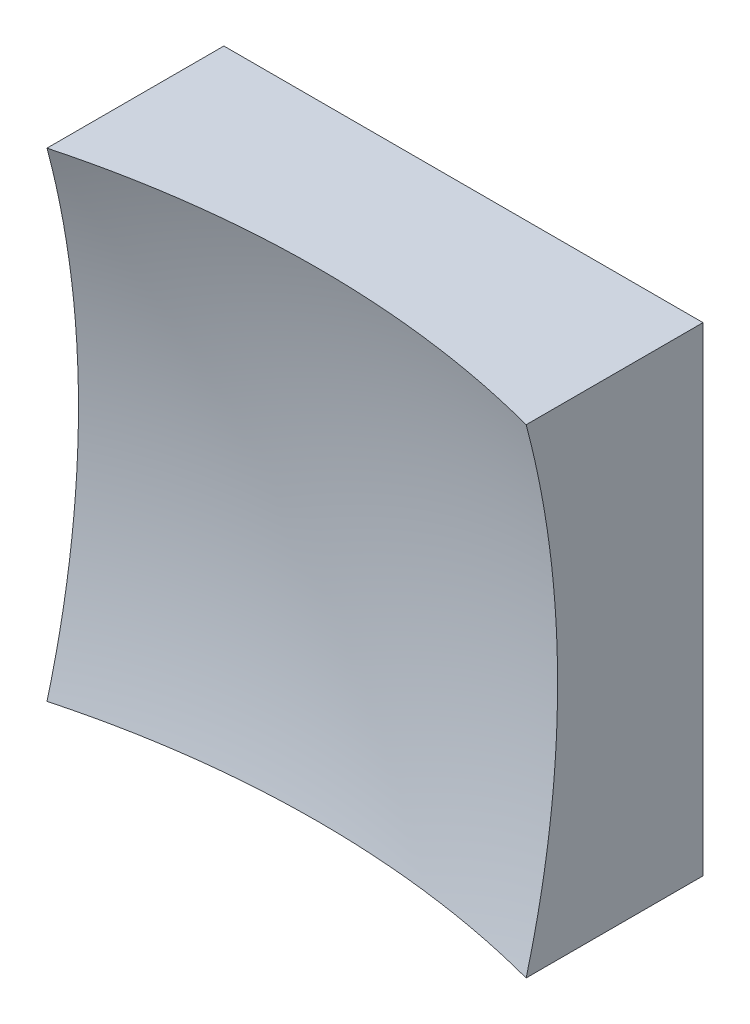
ISO-10303-21;
HEADER;
FILE_DESCRIPTION(('STEP AP214'),'2;1');
FILE_NAME('part.step','',(''),(''),'','','');
FILE_SCHEMA(('AUTOMOTIVE_DESIGN { 1 0 10303 214 1 1 1 1 }'));
ENDSEC;
DATA;
#1=APPLICATION_CONTEXT('core data for automotive mechanical design processes');
#2=APPLICATION_PROTOCOL_DEFINITION('international standard','automotive_design',2000,#1);
#3=PRODUCT_CONTEXT('',#1,'mechanical');
#4=PRODUCT('Part','Part','',(#3));
#5=PRODUCT_RELATED_PRODUCT_CATEGORY('part','',(#4));
#6=PRODUCT_DEFINITION_FORMATION('','',#4);
#7=PRODUCT_DEFINITION_CONTEXT('part definition',#1,'design');
#8=PRODUCT_DEFINITION('design','',#6,#7);
#9=PRODUCT_DEFINITION_SHAPE('','',#8);
#10=(LENGTH_UNIT() NAMED_UNIT(*) SI_UNIT(.MILLI.,.METRE.));
#11=(NAMED_UNIT(*) PLANE_ANGLE_UNIT() SI_UNIT($,.RADIAN.));
#12=(NAMED_UNIT(*) SI_UNIT($,.STERADIAN.) SOLID_ANGLE_UNIT());
#13=UNCERTAINTY_MEASURE_WITH_UNIT(LENGTH_MEASURE(1.E-05),#10,'distance_accuracy_value','');
#14=(GEOMETRIC_REPRESENTATION_CONTEXT(3) GLOBAL_UNCERTAINTY_ASSIGNED_CONTEXT((#13)) GLOBAL_UNIT_ASSIGNED_CONTEXT((#10,
#11,#12)) REPRESENTATION_CONTEXT('',''));
#15=CARTESIAN_POINT('',(0.,0.,0.));
#16=DIRECTION('',(0.,0.,1.));
#17=DIRECTION('',(1.,0.,0.));
#18=AXIS2_PLACEMENT_3D('',#15,#16,#17);
#19=CARTESIAN_POINT('',(-12.5,12.5,20.));
#20=DIRECTION('',(0.,1.,0.));
#21=DIRECTION('',(0.,0.,1.));
#22=AXIS2_PLACEMENT_3D('',#19,#20,#21);
#23=PLANE('',#22);
#24=CARTESIAN_POINT('',(0.,12.5,56.));
#25=DIRECTION('',(0.,1.,0.));
#26=DIRECTION('',(0.,0.,1.));
#27=AXIS2_PLACEMENT_3D('',#24,#25,#26);
#28=CIRCLE('',#27,48.4122918275927);
#29=CARTESIAN_POINT('',(12.5,12.5,9.22928266532573));
#30=VERTEX_POINT('',#29);
#31=CARTESIAN_POINT('',(-12.5,12.5,9.22928266532573));
#32=VERTEX_POINT('',#31);
#33=EDGE_CURVE('E79',#30,#32,#28,.T.);
#34=ORIENTED_EDGE('',*,*,#33,.F.);
#35=DIRECTION('',(0.,0.,-1.));
#36=VECTOR('',#35,1.);
#37=CARTESIAN_POINT('',(12.5,12.5,20.));
#38=LINE('',#37,#36);
#39=CARTESIAN_POINT('',(12.5,12.5,0.));
#40=VERTEX_POINT('',#39);
#41=EDGE_CURVE('E85',#30,#40,#38,.T.);
#42=ORIENTED_EDGE('',*,*,#41,.T.);
#43=DIRECTION('',(1.,0.,0.));
#44=VECTOR('',#43,1.);
#45=CARTESIAN_POINT('',(-12.5,12.5,0.));
#46=LINE('',#45,#44);
#47=CARTESIAN_POINT('',(-12.5,12.5,0.));
#48=VERTEX_POINT('',#47);
#49=EDGE_CURVE('E88',#48,#40,#46,.T.);
#50=ORIENTED_EDGE('',*,*,#49,.F.);
#51=DIRECTION('',(0.,0.,-1.));
#52=VECTOR('',#51,1.);
#53=CARTESIAN_POINT('',(-12.5,12.5,20.));
#54=LINE('',#53,#52);
#55=EDGE_CURVE('E47',#32,#48,#54,.T.);
#56=ORIENTED_EDGE('',*,*,#55,.F.);
#57=EDGE_LOOP('',(#34,#42,#50,#56));
#58=FACE_BOUND('',#57,.T.);
#59=ADVANCED_FACE('F39',(#58),#23,.T.);
#60=CARTESIAN_POINT('',(-12.5,12.5,20.));
#61=DIRECTION('',(1.,0.,0.));
#62=DIRECTION('',(0.,1.,0.));
#63=AXIS2_PLACEMENT_3D('',#60,#61,#62);
#64=PLANE('',#63);
#65=DIRECTION('',(0.,0.,-1.));
#66=VECTOR('',#65,1.);
#67=CARTESIAN_POINT('',(-12.5,-12.5,20.));
#68=LINE('',#67,#66);
#69=CARTESIAN_POINT('',(-12.5,-12.5,9.22928266532573));
#70=VERTEX_POINT('',#69);
#71=CARTESIAN_POINT('',(-12.5,-12.5,0.));
#72=VERTEX_POINT('',#71);
#73=EDGE_CURVE('E100',#70,#72,#68,.T.);
#74=ORIENTED_EDGE('',*,*,#73,.F.);
#75=CARTESIAN_POINT('',(-12.5,0.,56.));
#76=DIRECTION('',(1.,0.,0.));
#77=DIRECTION('',(0.,1.,0.));
#78=AXIS2_PLACEMENT_3D('',#75,#76,#77);
#79=CIRCLE('',#78,48.4122918275927);
#80=EDGE_CURVE('E89',#70,#32,#79,.T.);
#81=ORIENTED_EDGE('',*,*,#80,.T.);
#82=ORIENTED_EDGE('',*,*,#55,.T.);
#83=DIRECTION('',(0.,-1.,0.));
#84=VECTOR('',#83,1.);
#85=CARTESIAN_POINT('',(-12.5,12.5,0.));
#86=LINE('',#85,#84);
#87=EDGE_CURVE('E97',#48,#72,#86,.T.);
#88=ORIENTED_EDGE('',*,*,#87,.T.);
#89=EDGE_LOOP('',(#74,#81,#82,#88));
#90=FACE_BOUND('',#89,.T.);
#91=ADVANCED_FACE('F122',(#90),#64,.F.);
#92=CARTESIAN_POINT('',(-12.5,-12.5,20.));
#93=DIRECTION('',(0.,1.,0.));
#94=DIRECTION('',(0.,0.,1.));
#95=AXIS2_PLACEMENT_3D('',#92,#93,#94);
#96=PLANE('',#95);
#97=DIRECTION('',(0.,0.,-1.));
#98=VECTOR('',#97,1.);
#99=CARTESIAN_POINT('',(12.5,-12.5,20.));
#100=LINE('',#99,#98);
#101=CARTESIAN_POINT('',(12.5,-12.5,9.22928266532573));
#102=VERTEX_POINT('',#101);
#103=CARTESIAN_POINT('',(12.5,-12.5,0.));
#104=VERTEX_POINT('',#103);
#105=EDGE_CURVE('E96',#102,#104,#100,.T.);
#106=ORIENTED_EDGE('',*,*,#105,.F.);
#107=CARTESIAN_POINT('',(0.,-12.5,56.));
#108=DIRECTION('',(0.,1.,0.));
#109=DIRECTION('',(0.,0.,1.));
#110=AXIS2_PLACEMENT_3D('',#107,#108,#109);
#111=CIRCLE('',#110,48.4122918275927);
#112=EDGE_CURVE('E53',#102,#70,#111,.T.);
#113=ORIENTED_EDGE('',*,*,#112,.T.);
#114=ORIENTED_EDGE('',*,*,#73,.T.);
#115=DIRECTION('',(1.,0.,0.));
#116=VECTOR('',#115,1.);
#117=CARTESIAN_POINT('',(-12.5,-12.5,0.));
#118=LINE('',#117,#116);
#119=EDGE_CURVE('E102',#72,#104,#118,.T.);
#120=ORIENTED_EDGE('',*,*,#119,.T.);
#121=EDGE_LOOP('',(#106,#113,#114,#120));
#122=FACE_BOUND('',#121,.T.);
#123=ADVANCED_FACE('F121',(#122),#96,.F.);
#124=CARTESIAN_POINT('',(12.5,12.5,20.));
#125=DIRECTION('',(1.,0.,0.));
#126=DIRECTION('',(0.,1.,0.));
#127=AXIS2_PLACEMENT_3D('',#124,#125,#126);
#128=PLANE('',#127);
#129=CARTESIAN_POINT('',(12.5,0.,56.));
#130=DIRECTION('',(1.,0.,0.));
#131=DIRECTION('',(0.,1.,0.));
#132=AXIS2_PLACEMENT_3D('',#129,#130,#131);
#133=CIRCLE('',#132,48.4122918275927);
#134=EDGE_CURVE('E11',#102,#30,#133,.T.);
#135=ORIENTED_EDGE('',*,*,#134,.F.);
#136=ORIENTED_EDGE('',*,*,#105,.T.);
#137=DIRECTION('',(0.,-1.,0.));
#138=VECTOR('',#137,1.);
#139=CARTESIAN_POINT('',(12.5,12.5,0.));
#140=LINE('',#139,#138);
#141=EDGE_CURVE('E93',#40,#104,#140,.T.);
#142=ORIENTED_EDGE('',*,*,#141,.F.);
#143=ORIENTED_EDGE('',*,*,#41,.F.);
#144=EDGE_LOOP('',(#135,#136,#142,#143));
#145=FACE_BOUND('',#144,.T.);
#146=ADVANCED_FACE('F91',(#145),#128,.T.);
#147=CARTESIAN_POINT('',(0.,0.,0.));
#148=DIRECTION('',(0.,0.,-1.));
#149=DIRECTION('',(-1.,0.,0.));
#150=AXIS2_PLACEMENT_3D('',#147,#148,#149);
#151=PLANE('',#150);
#152=ORIENTED_EDGE('',*,*,#49,.T.);
#153=ORIENTED_EDGE('',*,*,#141,.T.);
#154=ORIENTED_EDGE('',*,*,#119,.F.);
#155=ORIENTED_EDGE('',*,*,#87,.F.);
#156=EDGE_LOOP('',(#152,#153,#154,#155));
#157=FACE_BOUND('',#156,.T.);
#158=ADVANCED_FACE('F125',(#157),#151,.T.);
#159=CARTESIAN_POINT('',(0.,0.,56.));
#160=DIRECTION('',(0.,0.,1.));
#161=DIRECTION('',(1.,0.,0.));
#162=AXIS2_PLACEMENT_3D('',#159,#160,#161);
#163=SPHERICAL_SURFACE('',#162,50.);
#164=ORIENTED_EDGE('',*,*,#33,.T.);
#165=ORIENTED_EDGE('',*,*,#80,.F.);
#166=ORIENTED_EDGE('',*,*,#112,.F.);
#167=ORIENTED_EDGE('',*,*,#134,.T.);
#168=EDGE_LOOP('',(#164,#165,#166,#167));
#169=FACE_BOUND('',#168,.T.);
#170=ADVANCED_FACE('F78',(#169),#163,.F.);
#171=CLOSED_SHELL('',(#59,#91,#123,#146,#158,#170));
#172=MANIFOLD_SOLID_BREP('B2',#171);
#173=ADVANCED_BREP_SHAPE_REPRESENTATION('',(#18,#172),#14);
#174=SHAPE_DEFINITION_REPRESENTATION(#9,#173);
ENDSEC;
END-ISO-10303-21;
